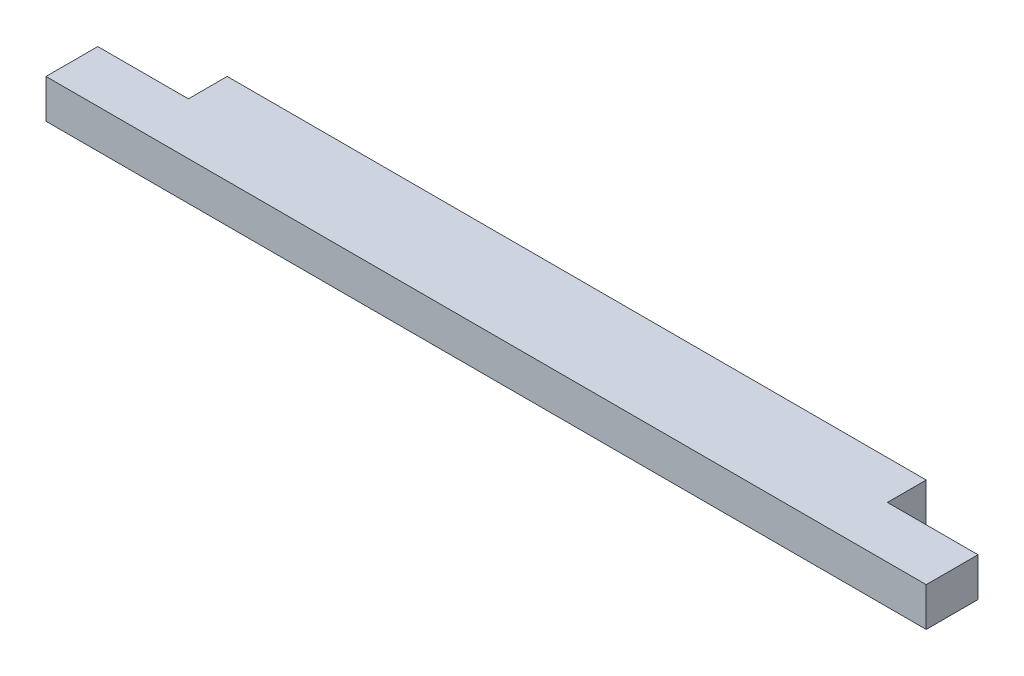
ISO-10303-21;
HEADER;
FILE_DESCRIPTION(('STEP AP214'),'2;1');
FILE_NAME('part.step','',(''),(''),'','','');
FILE_SCHEMA(('AUTOMOTIVE_DESIGN { 1 0 10303 214 1 1 1 1 }'));
ENDSEC;
DATA;
#1=APPLICATION_CONTEXT('core data for automotive mechanical design processes');
#2=APPLICATION_PROTOCOL_DEFINITION('international standard','automotive_design',2000,#1);
#3=PRODUCT_CONTEXT('',#1,'mechanical');
#4=PRODUCT('Part','Part','',(#3));
#5=PRODUCT_RELATED_PRODUCT_CATEGORY('part','',(#4));
#6=PRODUCT_DEFINITION_FORMATION('','',#4);
#7=PRODUCT_DEFINITION_CONTEXT('part definition',#1,'design');
#8=PRODUCT_DEFINITION('design','',#6,#7);
#9=PRODUCT_DEFINITION_SHAPE('','',#8);
#10=(LENGTH_UNIT() NAMED_UNIT(*) SI_UNIT(.MILLI.,.METRE.));
#11=(NAMED_UNIT(*) PLANE_ANGLE_UNIT() SI_UNIT($,.RADIAN.));
#12=(NAMED_UNIT(*) SI_UNIT($,.STERADIAN.) SOLID_ANGLE_UNIT());
#13=UNCERTAINTY_MEASURE_WITH_UNIT(LENGTH_MEASURE(1.E-05),#10,'distance_accuracy_value','');
#14=(GEOMETRIC_REPRESENTATION_CONTEXT(3) GLOBAL_UNCERTAINTY_ASSIGNED_CONTEXT((#13)) GLOBAL_UNIT_ASSIGNED_CONTEXT((#10,
#11,#12)) REPRESENTATION_CONTEXT('',''));
#15=CARTESIAN_POINT('',(0.,0.,0.));
#16=DIRECTION('',(0.,0.,1.));
#17=DIRECTION('',(1.,0.,0.));
#18=AXIS2_PLACEMENT_3D('',#15,#16,#17);
#19=CARTESIAN_POINT('',(0.,38.1,0.));
#20=DIRECTION('',(1.,0.,0.));
#21=DIRECTION('',(0.,0.,-1.));
#22=AXIS2_PLACEMENT_3D('',#19,#20,#21);
#23=PLANE('',#22);
#24=DIRECTION('',(0.,0.,1.));
#25=VECTOR('',#24,1.);
#26=CARTESIAN_POINT('',(0.,38.1,0.));
#27=LINE('',#26,#25);
#28=CARTESIAN_POINT('',(0.,38.1,-50.8));
#29=VERTEX_POINT('',#28);
#30=CARTESIAN_POINT('',(0.,38.1,0.));
#31=VERTEX_POINT('',#30);
#32=EDGE_CURVE('E118',#29,#31,#27,.T.);
#33=ORIENTED_EDGE('',*,*,#32,.F.);
#34=DIRECTION('',(0.,1.,0.));
#35=VECTOR('',#34,1.);
#36=CARTESIAN_POINT('',(0.,0.,-50.8));
#37=LINE('',#36,#35);
#38=CARTESIAN_POINT('',(0.,0.,-50.8));
#39=VERTEX_POINT('',#38);
#40=EDGE_CURVE('E106',#39,#29,#37,.T.);
#41=ORIENTED_EDGE('',*,*,#40,.F.);
#42=DIRECTION('',(0.,0.,1.));
#43=VECTOR('',#42,1.);
#44=CARTESIAN_POINT('',(0.,0.,0.));
#45=LINE('',#44,#43);
#46=CARTESIAN_POINT('',(0.,0.,0.));
#47=VERTEX_POINT('',#46);
#48=EDGE_CURVE('E116',#39,#47,#45,.T.);
#49=ORIENTED_EDGE('',*,*,#48,.T.);
#50=DIRECTION('',(0.,-1.,0.));
#51=VECTOR('',#50,1.);
#52=CARTESIAN_POINT('',(0.,38.1,0.));
#53=LINE('',#52,#51);
#54=EDGE_CURVE('E11',#31,#47,#53,.T.);
#55=ORIENTED_EDGE('',*,*,#54,.F.);
#56=EDGE_LOOP('',(#33,#41,#49,#55));
#57=FACE_BOUND('',#56,.T.);
#58=ADVANCED_FACE('F39',(#57),#23,.F.);
#59=CARTESIAN_POINT('',(0.,38.1,0.));
#60=DIRECTION('',(0.,0.,-1.));
#61=DIRECTION('',(-1.,0.,0.));
#62=AXIS2_PLACEMENT_3D('',#59,#60,#61);
#63=PLANE('',#62);
#64=DIRECTION('',(1.,0.,0.));
#65=VECTOR('',#64,1.);
#66=CARTESIAN_POINT('',(0.,0.,0.));
#67=LINE('',#66,#65);
#68=CARTESIAN_POINT('',(863.6,0.,0.));
#69=VERTEX_POINT('',#68);
#70=EDGE_CURVE('E122',#47,#69,#67,.T.);
#71=ORIENTED_EDGE('',*,*,#70,.T.);
#72=DIRECTION('',(0.,-1.,0.));
#73=VECTOR('',#72,1.);
#74=CARTESIAN_POINT('',(863.6,38.1,0.));
#75=LINE('',#74,#73);
#76=CARTESIAN_POINT('',(863.6,38.1,0.));
#77=VERTEX_POINT('',#76);
#78=EDGE_CURVE('E46',#77,#69,#75,.T.);
#79=ORIENTED_EDGE('',*,*,#78,.F.);
#80=DIRECTION('',(1.,0.,0.));
#81=VECTOR('',#80,1.);
#82=CARTESIAN_POINT('',(0.,38.1,0.));
#83=LINE('',#82,#81);
#84=EDGE_CURVE('E148',#31,#77,#83,.T.);
#85=ORIENTED_EDGE('',*,*,#84,.F.);
#86=ORIENTED_EDGE('',*,*,#54,.T.);
#87=EDGE_LOOP('',(#71,#79,#85,#86));
#88=FACE_BOUND('',#87,.T.);
#89=ADVANCED_FACE('F183',(#88),#63,.F.);
#90=CARTESIAN_POINT('',(863.6,38.1,0.));
#91=DIRECTION('',(-1.,0.,0.));
#92=DIRECTION('',(0.,0.,1.));
#93=AXIS2_PLACEMENT_3D('',#90,#91,#92);
#94=PLANE('',#93);
#95=DIRECTION('',(0.,0.,-1.));
#96=VECTOR('',#95,1.);
#97=CARTESIAN_POINT('',(863.6,0.,0.));
#98=LINE('',#97,#96);
#99=CARTESIAN_POINT('',(863.6,0.,-50.8));
#100=VERTEX_POINT('',#99);
#101=EDGE_CURVE('E125',#69,#100,#98,.T.);
#102=ORIENTED_EDGE('',*,*,#101,.T.);
#103=DIRECTION('',(0.,1.,0.));
#104=VECTOR('',#103,1.);
#105=CARTESIAN_POINT('',(863.6,0.,-50.8));
#106=LINE('',#105,#104);
#107=CARTESIAN_POINT('',(863.6,38.1,-50.8));
#108=VERTEX_POINT('',#107);
#109=EDGE_CURVE('E164',#100,#108,#106,.T.);
#110=ORIENTED_EDGE('',*,*,#109,.T.);
#111=DIRECTION('',(0.,0.,-1.));
#112=VECTOR('',#111,1.);
#113=CARTESIAN_POINT('',(863.6,38.1,0.));
#114=LINE('',#113,#112);
#115=EDGE_CURVE('E142',#77,#108,#114,.T.);
#116=ORIENTED_EDGE('',*,*,#115,.F.);
#117=ORIENTED_EDGE('',*,*,#78,.T.);
#118=EDGE_LOOP('',(#102,#110,#116,#117));
#119=FACE_BOUND('',#118,.T.);
#120=ADVANCED_FACE('F181',(#119),#94,.F.);
#121=CARTESIAN_POINT('',(0.,38.1,-88.9));
#122=DIRECTION('',(0.,0.,1.));
#123=DIRECTION('',(1.,0.,0.));
#124=AXIS2_PLACEMENT_3D('',#121,#122,#123);
#125=PLANE('',#124);
#126=DIRECTION('',(-1.,0.,0.));
#127=VECTOR('',#126,1.);
#128=CARTESIAN_POINT('',(0.,0.,-88.9));
#129=LINE('',#128,#127);
#130=CARTESIAN_POINT('',(774.7,0.,-88.9));
#131=VERTEX_POINT('',#130);
#132=CARTESIAN_POINT('',(88.9,0.,-88.9));
#133=VERTEX_POINT('',#132);
#134=EDGE_CURVE('E135',#131,#133,#129,.T.);
#135=ORIENTED_EDGE('',*,*,#134,.T.);
#136=DIRECTION('',(0.,1.,0.));
#137=VECTOR('',#136,1.);
#138=CARTESIAN_POINT('',(88.9,0.,-88.9));
#139=LINE('',#138,#137);
#140=CARTESIAN_POINT('',(88.9,38.1,-88.9));
#141=VERTEX_POINT('',#140);
#142=EDGE_CURVE('E123',#133,#141,#139,.T.);
#143=ORIENTED_EDGE('',*,*,#142,.T.);
#144=DIRECTION('',(-1.,0.,0.));
#145=VECTOR('',#144,1.);
#146=CARTESIAN_POINT('',(0.,38.1,-88.9));
#147=LINE('',#146,#145);
#148=CARTESIAN_POINT('',(774.7,38.1,-88.9));
#149=VERTEX_POINT('',#148);
#150=EDGE_CURVE('E130',#149,#141,#147,.T.);
#151=ORIENTED_EDGE('',*,*,#150,.F.);
#152=DIRECTION('',(0.,1.,0.));
#153=VECTOR('',#152,1.);
#154=CARTESIAN_POINT('',(774.7,0.,-88.9));
#155=LINE('',#154,#153);
#156=EDGE_CURVE('E158',#131,#149,#155,.T.);
#157=ORIENTED_EDGE('',*,*,#156,.F.);
#158=EDGE_LOOP('',(#135,#143,#151,#157));
#159=FACE_BOUND('',#158,.T.);
#160=ADVANCED_FACE('F176',(#159),#125,.F.);
#161=CARTESIAN_POINT('',(0.,38.1,0.));
#162=DIRECTION('',(0.,-1.,0.));
#163=DIRECTION('',(0.,0.,-1.));
#164=AXIS2_PLACEMENT_3D('',#161,#162,#163);
#165=PLANE('',#164);
#166=ORIENTED_EDGE('',*,*,#150,.T.);
#167=DIRECTION('',(0.,0.,-1.));
#168=VECTOR('',#167,1.);
#169=CARTESIAN_POINT('',(88.9,38.1,-88.9));
#170=LINE('',#169,#168);
#171=CARTESIAN_POINT('',(88.9,38.1,-50.8));
#172=VERTEX_POINT('',#171);
#173=EDGE_CURVE('E111',#172,#141,#170,.T.);
#174=ORIENTED_EDGE('',*,*,#173,.F.);
#175=DIRECTION('',(1.,0.,0.));
#176=VECTOR('',#175,1.);
#177=CARTESIAN_POINT('',(0.,38.1,-50.8));
#178=LINE('',#177,#176);
#179=EDGE_CURVE('E162',#29,#172,#178,.T.);
#180=ORIENTED_EDGE('',*,*,#179,.F.);
#181=ORIENTED_EDGE('',*,*,#32,.T.);
#182=ORIENTED_EDGE('',*,*,#84,.T.);
#183=ORIENTED_EDGE('',*,*,#115,.T.);
#184=DIRECTION('',(1.,0.,0.));
#185=VECTOR('',#184,1.);
#186=CARTESIAN_POINT('',(863.6,38.1,-50.8));
#187=LINE('',#186,#185);
#188=CARTESIAN_POINT('',(774.7,38.1,-50.8));
#189=VERTEX_POINT('',#188);
#190=EDGE_CURVE('E156',#189,#108,#187,.T.);
#191=ORIENTED_EDGE('',*,*,#190,.F.);
#192=DIRECTION('',(0.,0.,1.));
#193=VECTOR('',#192,1.);
#194=CARTESIAN_POINT('',(774.7,38.1,-88.9));
#195=LINE('',#194,#193);
#196=EDGE_CURVE('E159',#149,#189,#195,.T.);
#197=ORIENTED_EDGE('',*,*,#196,.F.);
#198=EDGE_LOOP('',(#166,#174,#180,#181,#182,#183,#191,#197));
#199=FACE_BOUND('',#198,.T.);
#200=ADVANCED_FACE('F179',(#199),#165,.F.);
#201=CARTESIAN_POINT('',(0.,0.,0.));
#202=DIRECTION('',(0.,-1.,0.));
#203=DIRECTION('',(0.,0.,-1.));
#204=AXIS2_PLACEMENT_3D('',#201,#202,#203);
#205=PLANE('',#204);
#206=DIRECTION('',(0.,0.,-1.));
#207=VECTOR('',#206,1.);
#208=CARTESIAN_POINT('',(88.9,0.,-88.9));
#209=LINE('',#208,#207);
#210=CARTESIAN_POINT('',(88.9,0.,-50.8));
#211=VERTEX_POINT('',#210);
#212=EDGE_CURVE('E53',#211,#133,#209,.T.);
#213=ORIENTED_EDGE('',*,*,#212,.T.);
#214=ORIENTED_EDGE('',*,*,#134,.F.);
#215=DIRECTION('',(0.,0.,1.));
#216=VECTOR('',#215,1.);
#217=CARTESIAN_POINT('',(774.7,0.,-88.9));
#218=LINE('',#217,#216);
#219=CARTESIAN_POINT('',(774.7,0.,-50.8));
#220=VERTEX_POINT('',#219);
#221=EDGE_CURVE('E153',#131,#220,#218,.T.);
#222=ORIENTED_EDGE('',*,*,#221,.T.);
#223=DIRECTION('',(1.,0.,0.));
#224=VECTOR('',#223,1.);
#225=CARTESIAN_POINT('',(863.6,0.,-50.8));
#226=LINE('',#225,#224);
#227=EDGE_CURVE('E61',#220,#100,#226,.T.);
#228=ORIENTED_EDGE('',*,*,#227,.T.);
#229=ORIENTED_EDGE('',*,*,#101,.F.);
#230=ORIENTED_EDGE('',*,*,#70,.F.);
#231=ORIENTED_EDGE('',*,*,#48,.F.);
#232=DIRECTION('',(1.,0.,0.));
#233=VECTOR('',#232,1.);
#234=CARTESIAN_POINT('',(0.,0.,-50.8));
#235=LINE('',#234,#233);
#236=EDGE_CURVE('E102',#39,#211,#235,.T.);
#237=ORIENTED_EDGE('',*,*,#236,.T.);
#238=EDGE_LOOP('',(#213,#214,#222,#228,#229,#230,#231,#237));
#239=FACE_BOUND('',#238,.T.);
#240=ADVANCED_FACE('F120',(#239),#205,.T.);
#241=CARTESIAN_POINT('',(863.6,0.,-50.8));
#242=DIRECTION('',(0.,0.,1.));
#243=DIRECTION('',(1.,0.,0.));
#244=AXIS2_PLACEMENT_3D('',#241,#242,#243);
#245=PLANE('',#244);
#246=ORIENTED_EDGE('',*,*,#190,.T.);
#247=ORIENTED_EDGE('',*,*,#109,.F.);
#248=ORIENTED_EDGE('',*,*,#227,.F.);
#249=DIRECTION('',(0.,1.,0.));
#250=VECTOR('',#249,1.);
#251=CARTESIAN_POINT('',(774.7,0.,-50.8));
#252=LINE('',#251,#250);
#253=EDGE_CURVE('E167',#220,#189,#252,.T.);
#254=ORIENTED_EDGE('',*,*,#253,.T.);
#255=EDGE_LOOP('',(#246,#247,#248,#254));
#256=FACE_BOUND('',#255,.T.);
#257=ADVANCED_FACE('F180',(#256),#245,.F.);
#258=CARTESIAN_POINT('',(774.7,0.,-88.9));
#259=DIRECTION('',(-1.,0.,0.));
#260=DIRECTION('',(0.,0.,1.));
#261=AXIS2_PLACEMENT_3D('',#258,#259,#260);
#262=PLANE('',#261);
#263=ORIENTED_EDGE('',*,*,#196,.T.);
#264=ORIENTED_EDGE('',*,*,#253,.F.);
#265=ORIENTED_EDGE('',*,*,#221,.F.);
#266=ORIENTED_EDGE('',*,*,#156,.T.);
#267=EDGE_LOOP('',(#263,#264,#265,#266));
#268=FACE_BOUND('',#267,.T.);
#269=ADVANCED_FACE('F178',(#268),#262,.F.);
#270=CARTESIAN_POINT('',(88.9,0.,-88.9));
#271=DIRECTION('',(1.,0.,0.));
#272=DIRECTION('',(0.,0.,-1.));
#273=AXIS2_PLACEMENT_3D('',#270,#271,#272);
#274=PLANE('',#273);
#275=ORIENTED_EDGE('',*,*,#173,.T.);
#276=ORIENTED_EDGE('',*,*,#142,.F.);
#277=ORIENTED_EDGE('',*,*,#212,.F.);
#278=DIRECTION('',(0.,1.,0.));
#279=VECTOR('',#278,1.);
#280=CARTESIAN_POINT('',(88.9,0.,-50.8));
#281=LINE('',#280,#279);
#282=EDGE_CURVE('E108',#211,#172,#281,.T.);
#283=ORIENTED_EDGE('',*,*,#282,.T.);
#284=EDGE_LOOP('',(#275,#276,#277,#283));
#285=FACE_BOUND('',#284,.T.);
#286=ADVANCED_FACE('F243',(#285),#274,.F.);
#287=CARTESIAN_POINT('',(0.,0.,-50.8));
#288=DIRECTION('',(0.,0.,1.));
#289=DIRECTION('',(1.,0.,0.));
#290=AXIS2_PLACEMENT_3D('',#287,#288,#289);
#291=PLANE('',#290);
#292=ORIENTED_EDGE('',*,*,#179,.T.);
#293=ORIENTED_EDGE('',*,*,#282,.F.);
#294=ORIENTED_EDGE('',*,*,#236,.F.);
#295=ORIENTED_EDGE('',*,*,#40,.T.);
#296=EDGE_LOOP('',(#292,#293,#294,#295));
#297=FACE_BOUND('',#296,.T.);
#298=ADVANCED_FACE('F105',(#297),#291,.F.);
#299=CLOSED_SHELL('',(#58,#89,#120,#160,#200,#240,#257,#269,#286,#298));
#300=MANIFOLD_SOLID_BREP('B2',#299);
#301=ADVANCED_BREP_SHAPE_REPRESENTATION('',(#18,#300),#14);
#302=SHAPE_DEFINITION_REPRESENTATION(#9,#301);
ENDSEC;
END-ISO-10303-21;
